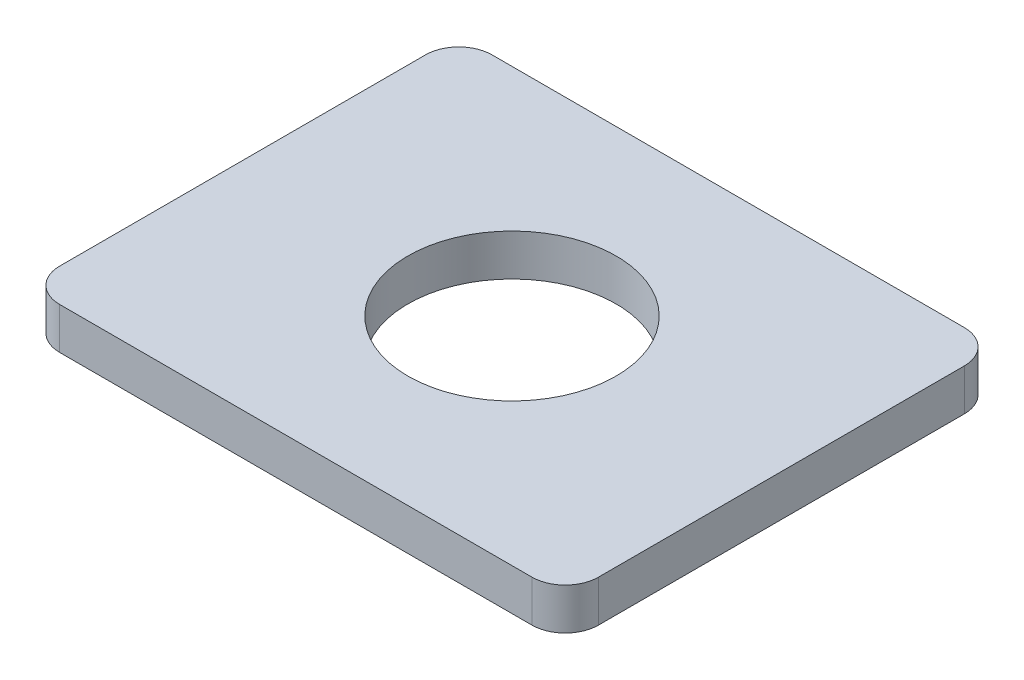
ISO-10303-21;
HEADER;
FILE_DESCRIPTION(('STEP AP214'),'2;1');
FILE_NAME('part.step','',(''),(''),'','','');
FILE_SCHEMA(('AUTOMOTIVE_DESIGN { 1 0 10303 214 1 1 1 1 }'));
ENDSEC;
DATA;
#1=APPLICATION_CONTEXT('core data for automotive mechanical design processes');
#2=APPLICATION_PROTOCOL_DEFINITION('international standard','automotive_design',2000,#1);
#3=PRODUCT_CONTEXT('',#1,'mechanical');
#4=PRODUCT('Part','Part','',(#3));
#5=PRODUCT_RELATED_PRODUCT_CATEGORY('part','',(#4));
#6=PRODUCT_DEFINITION_FORMATION('','',#4);
#7=PRODUCT_DEFINITION_CONTEXT('part definition',#1,'design');
#8=PRODUCT_DEFINITION('design','',#6,#7);
#9=PRODUCT_DEFINITION_SHAPE('','',#8);
#10=(LENGTH_UNIT() NAMED_UNIT(*) SI_UNIT(.MILLI.,.METRE.));
#11=(NAMED_UNIT(*) PLANE_ANGLE_UNIT() SI_UNIT($,.RADIAN.));
#12=(NAMED_UNIT(*) SI_UNIT($,.STERADIAN.) SOLID_ANGLE_UNIT());
#13=UNCERTAINTY_MEASURE_WITH_UNIT(LENGTH_MEASURE(1.E-05),#10,'distance_accuracy_value','');
#14=(GEOMETRIC_REPRESENTATION_CONTEXT(3) GLOBAL_UNCERTAINTY_ASSIGNED_CONTEXT((#13)) GLOBAL_UNIT_ASSIGNED_CONTEXT((#10,
#11,#12)) REPRESENTATION_CONTEXT('',''));
#15=CARTESIAN_POINT('',(0.,0.,0.));
#16=DIRECTION('',(0.,0.,1.));
#17=DIRECTION('',(1.,0.,0.));
#18=AXIS2_PLACEMENT_3D('',#15,#16,#17);
#19=CARTESIAN_POINT('',(18.034,3.175,-13.97));
#20=DIRECTION('',(0.,-1.,0.));
#21=DIRECTION('',(0.,0.,-1.));
#22=AXIS2_PLACEMENT_3D('',#19,#20,#21);
#23=CYLINDRICAL_SURFACE('',#22,2.54);
#24=CARTESIAN_POINT('',(18.034,0.,-13.97));
#25=DIRECTION('',(0.,1.,0.));
#26=DIRECTION('',(0.,0.,1.));
#27=AXIS2_PLACEMENT_3D('',#24,#25,#26);
#28=CIRCLE('',#27,2.54);
#29=CARTESIAN_POINT('',(20.574,0.,-13.97));
#30=VERTEX_POINT('',#29);
#31=CARTESIAN_POINT('',(18.034,0.,-16.51));
#32=VERTEX_POINT('',#31);
#33=EDGE_CURVE('E130',#30,#32,#28,.T.);
#34=ORIENTED_EDGE('',*,*,#33,.T.);
#35=DIRECTION('',(0.,-1.,0.));
#36=VECTOR('',#35,1.);
#37=CARTESIAN_POINT('',(18.034,3.175,-16.51));
#38=LINE('',#37,#36);
#39=CARTESIAN_POINT('',(18.034,3.175,-16.51));
#40=VERTEX_POINT('',#39);
#41=EDGE_CURVE('E11',#40,#32,#38,.T.);
#42=ORIENTED_EDGE('',*,*,#41,.F.);
#43=CARTESIAN_POINT('',(18.034,3.175,-13.97));
#44=DIRECTION('',(0.,1.,0.));
#45=DIRECTION('',(0.,0.,1.));
#46=AXIS2_PLACEMENT_3D('',#43,#44,#45);
#47=CIRCLE('',#46,2.54);
#48=CARTESIAN_POINT('',(20.574,3.175,-13.97));
#49=VERTEX_POINT('',#48);
#50=EDGE_CURVE('E145',#49,#40,#47,.T.);
#51=ORIENTED_EDGE('',*,*,#50,.F.);
#52=DIRECTION('',(0.,-1.,0.));
#53=VECTOR('',#52,1.);
#54=CARTESIAN_POINT('',(20.574,3.175,-13.97));
#55=LINE('',#54,#53);
#56=EDGE_CURVE('E126',#49,#30,#55,.T.);
#57=ORIENTED_EDGE('',*,*,#56,.T.);
#58=EDGE_LOOP('',(#34,#42,#51,#57));
#59=FACE_BOUND('',#58,.T.);
#60=ADVANCED_FACE('F34',(#59),#23,.T.);
#61=CARTESIAN_POINT('',(18.034,3.175,-16.51));
#62=DIRECTION('',(0.,0.,1.));
#63=DIRECTION('',(1.,0.,0.));
#64=AXIS2_PLACEMENT_3D('',#61,#62,#63);
#65=PLANE('',#64);
#66=DIRECTION('',(-1.,0.,0.));
#67=VECTOR('',#66,1.);
#68=CARTESIAN_POINT('',(18.034,0.,-16.51));
#69=LINE('',#68,#67);
#70=CARTESIAN_POINT('',(-18.034,0.,-16.51));
#71=VERTEX_POINT('',#70);
#72=EDGE_CURVE('E133',#32,#71,#69,.T.);
#73=ORIENTED_EDGE('',*,*,#72,.T.);
#74=DIRECTION('',(0.,-1.,0.));
#75=VECTOR('',#74,1.);
#76=CARTESIAN_POINT('',(-18.034,3.175,-16.51));
#77=LINE('',#76,#75);
#78=CARTESIAN_POINT('',(-18.034,3.175,-16.51));
#79=VERTEX_POINT('',#78);
#80=EDGE_CURVE('E42',#79,#71,#77,.T.);
#81=ORIENTED_EDGE('',*,*,#80,.F.);
#82=DIRECTION('',(-1.,0.,0.));
#83=VECTOR('',#82,1.);
#84=CARTESIAN_POINT('',(18.034,3.175,-16.51));
#85=LINE('',#84,#83);
#86=EDGE_CURVE('E93',#40,#79,#85,.T.);
#87=ORIENTED_EDGE('',*,*,#86,.F.);
#88=ORIENTED_EDGE('',*,*,#41,.T.);
#89=EDGE_LOOP('',(#73,#81,#87,#88));
#90=FACE_BOUND('',#89,.T.);
#91=ADVANCED_FACE('F201',(#90),#65,.F.);
#92=CARTESIAN_POINT('',(-18.034,3.175,-13.97));
#93=DIRECTION('',(0.,-1.,0.));
#94=DIRECTION('',(0.,0.,-1.));
#95=AXIS2_PLACEMENT_3D('',#92,#93,#94);
#96=CYLINDRICAL_SURFACE('',#95,2.54);
#97=CARTESIAN_POINT('',(-18.034,0.,-13.97));
#98=DIRECTION('',(0.,1.,0.));
#99=DIRECTION('',(0.,0.,1.));
#100=AXIS2_PLACEMENT_3D('',#97,#98,#99);
#101=CIRCLE('',#100,2.54);
#102=CARTESIAN_POINT('',(-20.574,0.,-13.97));
#103=VERTEX_POINT('',#102);
#104=EDGE_CURVE('E136',#71,#103,#101,.T.);
#105=ORIENTED_EDGE('',*,*,#104,.T.);
#106=DIRECTION('',(0.,-1.,0.));
#107=VECTOR('',#106,1.);
#108=CARTESIAN_POINT('',(-20.574,3.175,-13.97));
#109=LINE('',#108,#107);
#110=CARTESIAN_POINT('',(-20.574,3.175,-13.97));
#111=VERTEX_POINT('',#110);
#112=EDGE_CURVE('E152',#111,#103,#109,.T.);
#113=ORIENTED_EDGE('',*,*,#112,.F.);
#114=CARTESIAN_POINT('',(-18.034,3.175,-13.97));
#115=DIRECTION('',(0.,1.,0.));
#116=DIRECTION('',(0.,0.,1.));
#117=AXIS2_PLACEMENT_3D('',#114,#115,#116);
#118=CIRCLE('',#117,2.54);
#119=EDGE_CURVE('E160',#79,#111,#118,.T.);
#120=ORIENTED_EDGE('',*,*,#119,.F.);
#121=ORIENTED_EDGE('',*,*,#80,.T.);
#122=EDGE_LOOP('',(#105,#113,#120,#121));
#123=FACE_BOUND('',#122,.T.);
#124=ADVANCED_FACE('F158',(#123),#96,.T.);
#125=CARTESIAN_POINT('',(-20.574,3.175,13.97));
#126=DIRECTION('',(1.,0.,0.));
#127=DIRECTION('',(0.,0.,-1.));
#128=AXIS2_PLACEMENT_3D('',#125,#126,#127);
#129=PLANE('',#128);
#130=DIRECTION('',(0.,0.,1.));
#131=VECTOR('',#130,1.);
#132=CARTESIAN_POINT('',(-20.574,0.,13.97));
#133=LINE('',#132,#131);
#134=CARTESIAN_POINT('',(-20.574,0.,13.97));
#135=VERTEX_POINT('',#134);
#136=EDGE_CURVE('E138',#103,#135,#133,.T.);
#137=ORIENTED_EDGE('',*,*,#136,.T.);
#138=DIRECTION('',(0.,-1.,0.));
#139=VECTOR('',#138,1.);
#140=CARTESIAN_POINT('',(-20.574,3.175,13.97));
#141=LINE('',#140,#139);
#142=CARTESIAN_POINT('',(-20.574,3.175,13.97));
#143=VERTEX_POINT('',#142);
#144=EDGE_CURVE('E149',#143,#135,#141,.T.);
#145=ORIENTED_EDGE('',*,*,#144,.F.);
#146=DIRECTION('',(0.,0.,1.));
#147=VECTOR('',#146,1.);
#148=CARTESIAN_POINT('',(-20.574,3.175,13.97));
#149=LINE('',#148,#147);
#150=EDGE_CURVE('E172',#111,#143,#149,.T.);
#151=ORIENTED_EDGE('',*,*,#150,.F.);
#152=ORIENTED_EDGE('',*,*,#112,.T.);
#153=EDGE_LOOP('',(#137,#145,#151,#152));
#154=FACE_BOUND('',#153,.T.);
#155=ADVANCED_FACE('F168',(#154),#129,.F.);
#156=CARTESIAN_POINT('',(-18.034,3.175,13.97));
#157=DIRECTION('',(0.,-1.,0.));
#158=DIRECTION('',(0.,0.,-1.));
#159=AXIS2_PLACEMENT_3D('',#156,#157,#158);
#160=CYLINDRICAL_SURFACE('',#159,2.54);
#161=CARTESIAN_POINT('',(-18.034,0.,13.97));
#162=DIRECTION('',(0.,1.,0.));
#163=DIRECTION('',(0.,0.,-1.));
#164=AXIS2_PLACEMENT_3D('',#161,#162,#163);
#165=CIRCLE('',#164,2.54);
#166=CARTESIAN_POINT('',(-18.034,0.,16.51));
#167=VERTEX_POINT('',#166);
#168=EDGE_CURVE('E140',#135,#167,#165,.T.);
#169=ORIENTED_EDGE('',*,*,#168,.T.);
#170=DIRECTION('',(0.,-1.,0.));
#171=VECTOR('',#170,1.);
#172=CARTESIAN_POINT('',(-18.034,3.175,16.51));
#173=LINE('',#172,#171);
#174=CARTESIAN_POINT('',(-18.034,3.175,16.51));
#175=VERTEX_POINT('',#174);
#176=EDGE_CURVE('E121',#175,#167,#173,.T.);
#177=ORIENTED_EDGE('',*,*,#176,.F.);
#178=CARTESIAN_POINT('',(-18.034,3.175,13.97));
#179=DIRECTION('',(0.,1.,0.));
#180=DIRECTION('',(0.,0.,-1.));
#181=AXIS2_PLACEMENT_3D('',#178,#179,#180);
#182=CIRCLE('',#181,2.54);
#183=EDGE_CURVE('E112',#143,#175,#182,.T.);
#184=ORIENTED_EDGE('',*,*,#183,.F.);
#185=ORIENTED_EDGE('',*,*,#144,.T.);
#186=EDGE_LOOP('',(#169,#177,#184,#185));
#187=FACE_BOUND('',#186,.T.);
#188=ADVANCED_FACE('F171',(#187),#160,.T.);
#189=CARTESIAN_POINT('',(18.034,3.175,16.51));
#190=DIRECTION('',(0.,0.,-1.));
#191=DIRECTION('',(-1.,0.,0.));
#192=AXIS2_PLACEMENT_3D('',#189,#190,#191);
#193=PLANE('',#192);
#194=DIRECTION('',(1.,0.,0.));
#195=VECTOR('',#194,1.);
#196=CARTESIAN_POINT('',(18.034,0.,16.51));
#197=LINE('',#196,#195);
#198=CARTESIAN_POINT('',(18.034,0.,16.51));
#199=VERTEX_POINT('',#198);
#200=EDGE_CURVE('E120',#167,#199,#197,.T.);
#201=ORIENTED_EDGE('',*,*,#200,.T.);
#202=DIRECTION('',(0.,-1.,0.));
#203=VECTOR('',#202,1.);
#204=CARTESIAN_POINT('',(18.034,3.175,16.51));
#205=LINE('',#204,#203);
#206=CARTESIAN_POINT('',(18.034,3.175,16.51));
#207=VERTEX_POINT('',#206);
#208=EDGE_CURVE('E117',#207,#199,#205,.T.);
#209=ORIENTED_EDGE('',*,*,#208,.F.);
#210=DIRECTION('',(1.,0.,0.));
#211=VECTOR('',#210,1.);
#212=CARTESIAN_POINT('',(18.034,3.175,16.51));
#213=LINE('',#212,#211);
#214=EDGE_CURVE('E106',#175,#207,#213,.T.);
#215=ORIENTED_EDGE('',*,*,#214,.F.);
#216=ORIENTED_EDGE('',*,*,#176,.T.);
#217=EDGE_LOOP('',(#201,#209,#215,#216));
#218=FACE_BOUND('',#217,.T.);
#219=ADVANCED_FACE('F118',(#218),#193,.F.);
#220=CARTESIAN_POINT('',(18.034,3.175,13.97));
#221=DIRECTION('',(0.,-1.,0.));
#222=DIRECTION('',(0.,0.,-1.));
#223=AXIS2_PLACEMENT_3D('',#220,#221,#222);
#224=CYLINDRICAL_SURFACE('',#223,2.54);
#225=CARTESIAN_POINT('',(18.034,0.,13.97));
#226=DIRECTION('',(0.,1.,0.));
#227=DIRECTION('',(0.,0.,1.));
#228=AXIS2_PLACEMENT_3D('',#225,#226,#227);
#229=CIRCLE('',#228,2.54);
#230=CARTESIAN_POINT('',(20.574,0.,13.97));
#231=VERTEX_POINT('',#230);
#232=EDGE_CURVE('E79',#199,#231,#229,.T.);
#233=ORIENTED_EDGE('',*,*,#232,.T.);
#234=DIRECTION('',(0.,-1.,0.));
#235=VECTOR('',#234,1.);
#236=CARTESIAN_POINT('',(20.574,3.175,13.97));
#237=LINE('',#236,#235);
#238=CARTESIAN_POINT('',(20.574,3.175,13.97));
#239=VERTEX_POINT('',#238);
#240=EDGE_CURVE('E122',#239,#231,#237,.T.);
#241=ORIENTED_EDGE('',*,*,#240,.F.);
#242=CARTESIAN_POINT('',(18.034,3.175,13.97));
#243=DIRECTION('',(0.,1.,0.));
#244=DIRECTION('',(0.,0.,1.));
#245=AXIS2_PLACEMENT_3D('',#242,#243,#244);
#246=CIRCLE('',#245,2.54);
#247=EDGE_CURVE('E110',#207,#239,#246,.T.);
#248=ORIENTED_EDGE('',*,*,#247,.F.);
#249=ORIENTED_EDGE('',*,*,#208,.T.);
#250=EDGE_LOOP('',(#233,#241,#248,#249));
#251=FACE_BOUND('',#250,.T.);
#252=ADVANCED_FACE('F124',(#251),#224,.T.);
#253=CARTESIAN_POINT('',(20.574,3.175,13.97));
#254=DIRECTION('',(-1.,0.,0.));
#255=DIRECTION('',(0.,0.,1.));
#256=AXIS2_PLACEMENT_3D('',#253,#254,#255);
#257=PLANE('',#256);
#258=DIRECTION('',(0.,0.,-1.));
#259=VECTOR('',#258,1.);
#260=CARTESIAN_POINT('',(20.574,0.,13.97));
#261=LINE('',#260,#259);
#262=EDGE_CURVE('E85',#231,#30,#261,.T.);
#263=ORIENTED_EDGE('',*,*,#262,.T.);
#264=ORIENTED_EDGE('',*,*,#56,.F.);
#265=DIRECTION('',(0.,0.,-1.));
#266=VECTOR('',#265,1.);
#267=CARTESIAN_POINT('',(20.574,3.175,13.97));
#268=LINE('',#267,#266);
#269=EDGE_CURVE('E50',#239,#49,#268,.T.);
#270=ORIENTED_EDGE('',*,*,#269,.F.);
#271=ORIENTED_EDGE('',*,*,#240,.T.);
#272=EDGE_LOOP('',(#263,#264,#270,#271));
#273=FACE_BOUND('',#272,.T.);
#274=ADVANCED_FACE('F192',(#273),#257,.F.);
#275=CARTESIAN_POINT('',(18.034,3.175,-13.97));
#276=DIRECTION('',(0.,1.,0.));
#277=DIRECTION('',(0.,0.,1.));
#278=AXIS2_PLACEMENT_3D('',#275,#276,#277);
#279=PLANE('',#278);
#280=CARTESIAN_POINT('',(0.,3.175,0.));
#281=DIRECTION('',(0.,1.,0.));
#282=DIRECTION('',(0.,0.,1.));
#283=AXIS2_PLACEMENT_3D('',#280,#281,#282);
#284=CIRCLE('',#283,7.9502);
#285=CARTESIAN_POINT('',(0.,3.175,7.9502));
#286=VERTEX_POINT('',#285);
#287=EDGE_CURVE('E178',#286,#286,#284,.T.);
#288=ORIENTED_EDGE('',*,*,#287,.F.);
#289=EDGE_LOOP('',(#288));
#290=FACE_BOUND('',#289,.T.);
#291=ORIENTED_EDGE('',*,*,#50,.T.);
#292=ORIENTED_EDGE('',*,*,#86,.T.);
#293=ORIENTED_EDGE('',*,*,#119,.T.);
#294=ORIENTED_EDGE('',*,*,#150,.T.);
#295=ORIENTED_EDGE('',*,*,#183,.T.);
#296=ORIENTED_EDGE('',*,*,#214,.T.);
#297=ORIENTED_EDGE('',*,*,#247,.T.);
#298=ORIENTED_EDGE('',*,*,#269,.T.);
#299=EDGE_LOOP('',(#291,#292,#293,#294,#295,#296,#297,#298));
#300=FACE_BOUND('',#299,.T.);
#301=ADVANCED_FACE('F108',(#290,#300),#279,.T.);
#302=CARTESIAN_POINT('',(18.034,0.,-13.97));
#303=DIRECTION('',(0.,1.,0.));
#304=DIRECTION('',(0.,0.,1.));
#305=AXIS2_PLACEMENT_3D('',#302,#303,#304);
#306=PLANE('',#305);
#307=CARTESIAN_POINT('',(0.,0.,0.));
#308=DIRECTION('',(0.,1.,0.));
#309=DIRECTION('',(0.,0.,1.));
#310=AXIS2_PLACEMENT_3D('',#307,#308,#309);
#311=CIRCLE('',#310,7.9502);
#312=CARTESIAN_POINT('',(0.,0.,7.9502));
#313=VERTEX_POINT('',#312);
#314=EDGE_CURVE('E134',#313,#313,#311,.T.);
#315=ORIENTED_EDGE('',*,*,#314,.T.);
#316=EDGE_LOOP('',(#315));
#317=FACE_BOUND('',#316,.T.);
#318=ORIENTED_EDGE('',*,*,#33,.F.);
#319=ORIENTED_EDGE('',*,*,#262,.F.);
#320=ORIENTED_EDGE('',*,*,#232,.F.);
#321=ORIENTED_EDGE('',*,*,#200,.F.);
#322=ORIENTED_EDGE('',*,*,#168,.F.);
#323=ORIENTED_EDGE('',*,*,#136,.F.);
#324=ORIENTED_EDGE('',*,*,#104,.F.);
#325=ORIENTED_EDGE('',*,*,#72,.F.);
#326=EDGE_LOOP('',(#318,#319,#320,#321,#322,#323,#324,#325));
#327=FACE_BOUND('',#326,.T.);
#328=ADVANCED_FACE('F164',(#317,#327),#306,.F.);
#329=CARTESIAN_POINT('',(0.,0.,0.));
#330=DIRECTION('',(0.,1.,0.));
#331=DIRECTION('',(0.,0.,1.));
#332=AXIS2_PLACEMENT_3D('',#329,#330,#331);
#333=CYLINDRICAL_SURFACE('',#332,7.9502);
#334=ORIENTED_EDGE('',*,*,#314,.F.);
#335=EDGE_LOOP('',(#334));
#336=FACE_BOUND('',#335,.T.);
#337=ORIENTED_EDGE('',*,*,#287,.T.);
#338=EDGE_LOOP('',(#337));
#339=FACE_BOUND('',#338,.T.);
#340=ADVANCED_FACE('F185',(#336,#339),#333,.F.);
#341=CLOSED_SHELL('',(#60,#91,#124,#155,#188,#219,#252,#274,#301,#328,#340));
#342=MANIFOLD_SOLID_BREP('B2',#341);
#343=ADVANCED_BREP_SHAPE_REPRESENTATION('',(#18,#342),#14);
#344=SHAPE_DEFINITION_REPRESENTATION(#9,#343);
ENDSEC;
END-ISO-10303-21;
